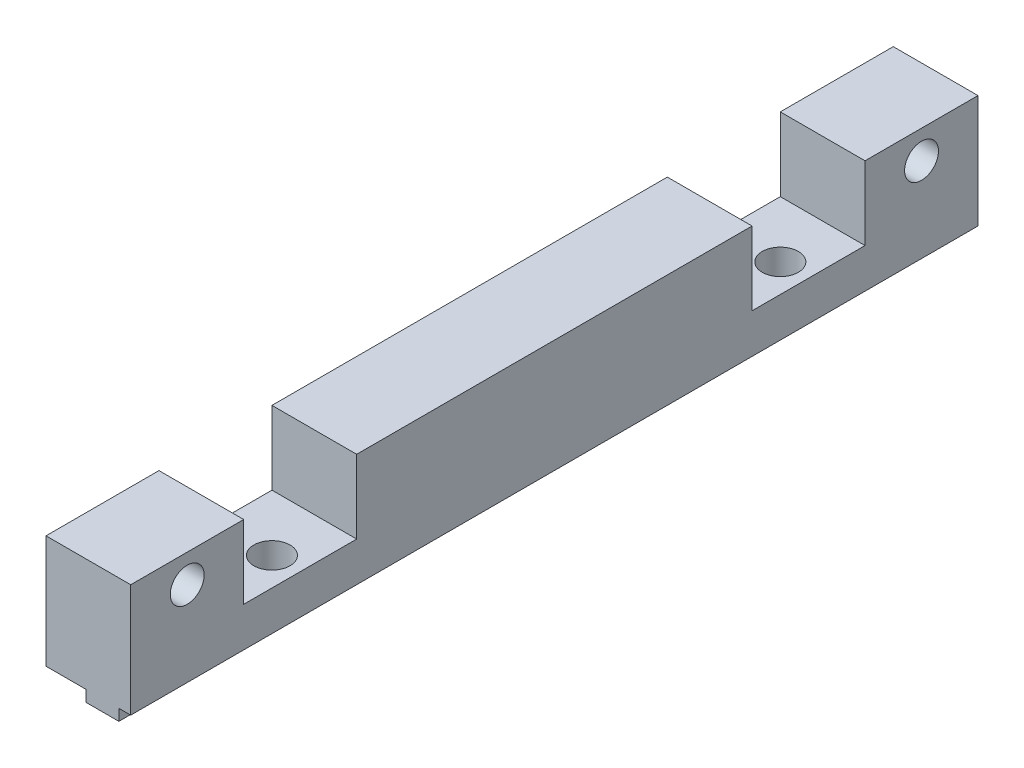
ISO-10303-21;
HEADER;
FILE_DESCRIPTION(('STEP AP214'),'2;1');
FILE_NAME('part.step','',(''),(''),'','','');
FILE_SCHEMA(('AUTOMOTIVE_DESIGN { 1 0 10303 214 1 1 1 1 }'));
ENDSEC;
DATA;
#1=APPLICATION_CONTEXT('core data for automotive mechanical design processes');
#2=APPLICATION_PROTOCOL_DEFINITION('international standard','automotive_design',2000,#1);
#3=PRODUCT_CONTEXT('',#1,'mechanical');
#4=PRODUCT('Part','Part','',(#3));
#5=PRODUCT_RELATED_PRODUCT_CATEGORY('part','',(#4));
#6=PRODUCT_DEFINITION_FORMATION('','',#4);
#7=PRODUCT_DEFINITION_CONTEXT('part definition',#1,'design');
#8=PRODUCT_DEFINITION('design','',#6,#7);
#9=PRODUCT_DEFINITION_SHAPE('','',#8);
#10=(LENGTH_UNIT() NAMED_UNIT(*) SI_UNIT(.MILLI.,.METRE.));
#11=(NAMED_UNIT(*) PLANE_ANGLE_UNIT() SI_UNIT($,.RADIAN.));
#12=(NAMED_UNIT(*) SI_UNIT($,.STERADIAN.) SOLID_ANGLE_UNIT());
#13=UNCERTAINTY_MEASURE_WITH_UNIT(LENGTH_MEASURE(1.E-05),#10,'distance_accuracy_value','');
#14=(GEOMETRIC_REPRESENTATION_CONTEXT(3) GLOBAL_UNCERTAINTY_ASSIGNED_CONTEXT((#13)) GLOBAL_UNIT_ASSIGNED_CONTEXT((#10,
#11,#12)) REPRESENTATION_CONTEXT('',''));
#15=CARTESIAN_POINT('',(0.,0.,0.));
#16=DIRECTION('',(0.,0.,1.));
#17=DIRECTION('',(1.,0.,0.));
#18=AXIS2_PLACEMENT_3D('',#15,#16,#17);
#19=CARTESIAN_POINT('',(6.45,-1.,75.));
#20=DIRECTION('',(0.,1.,0.));
#21=DIRECTION('',(0.,0.,1.));
#22=AXIS2_PLACEMENT_3D('',#19,#20,#21);
#23=PLANE('',#22);
#24=DIRECTION('',(0.,0.,-1.));
#25=VECTOR('',#24,1.);
#26=CARTESIAN_POINT('',(6.45,-1.,75.));
#27=LINE('',#26,#25);
#28=CARTESIAN_POINT('',(6.45,-1.,14.3236125370766));
#29=VERTEX_POINT('',#28);
#30=CARTESIAN_POINT('',(6.45,-1.,0.));
#31=VERTEX_POINT('',#30);
#32=EDGE_CURVE('E207',#29,#31,#27,.T.);
#33=ORIENTED_EDGE('',*,*,#32,.F.);
#34=CARTESIAN_POINT('',(5.,-1.,15.));
#35=DIRECTION('',(0.,-1.,0.));
#36=DIRECTION('',(0.,0.,-1.));
#37=AXIS2_PLACEMENT_3D('',#34,#35,#36);
#38=CIRCLE('',#37,1.6);
#39=CARTESIAN_POINT('',(3.55,-1.,14.3236125370766));
#40=VERTEX_POINT('',#39);
#41=EDGE_CURVE('E194',#40,#29,#38,.T.);
#42=ORIENTED_EDGE('',*,*,#41,.F.);
#43=DIRECTION('',(0.,0.,-1.));
#44=VECTOR('',#43,1.);
#45=CARTESIAN_POINT('',(3.55,-1.,75.));
#46=LINE('',#45,#44);
#47=CARTESIAN_POINT('',(3.55,-1.,0.));
#48=VERTEX_POINT('',#47);
#49=EDGE_CURVE('E225',#40,#48,#46,.T.);
#50=ORIENTED_EDGE('',*,*,#49,.T.);
#51=DIRECTION('',(1.,0.,0.));
#52=VECTOR('',#51,1.);
#53=CARTESIAN_POINT('',(6.45,-1.,0.));
#54=LINE('',#53,#52);
#55=EDGE_CURVE('E213',#48,#31,#54,.T.);
#56=ORIENTED_EDGE('',*,*,#55,.T.);
#57=EDGE_LOOP('',(#33,#42,#50,#56));
#58=FACE_BOUND('',#57,.T.);
#59=ADVANCED_FACE('F33',(#58),#23,.F.);
#60=CARTESIAN_POINT('',(6.45,0.,75.));
#61=DIRECTION('',(-1.,0.,0.));
#62=DIRECTION('',(0.,-1.,0.));
#63=AXIS2_PLACEMENT_3D('',#60,#61,#62);
#64=PLANE('',#63);
#65=DIRECTION('',(0.,0.,-1.));
#66=VECTOR('',#65,1.);
#67=CARTESIAN_POINT('',(6.45,0.,75.));
#68=LINE('',#67,#66);
#69=CARTESIAN_POINT('',(6.45,0.,14.3236125370766));
#70=VERTEX_POINT('',#69);
#71=CARTESIAN_POINT('',(6.45,0.,0.));
#72=VERTEX_POINT('',#71);
#73=EDGE_CURVE('E209',#70,#72,#68,.T.);
#74=ORIENTED_EDGE('',*,*,#73,.F.);
#75=DIRECTION('',(0.,-1.,0.));
#76=VECTOR('',#75,1.);
#77=CARTESIAN_POINT('',(6.45000000000002,10.,14.3236125370766));
#78=LINE('',#77,#76);
#79=EDGE_CURVE('E50',#70,#29,#78,.T.);
#80=ORIENTED_EDGE('',*,*,#79,.T.);
#81=ORIENTED_EDGE('',*,*,#32,.T.);
#82=DIRECTION('',(0.,1.,0.));
#83=VECTOR('',#82,1.);
#84=CARTESIAN_POINT('',(6.45,0.,0.));
#85=LINE('',#84,#83);
#86=EDGE_CURVE('E357',#31,#72,#85,.T.);
#87=ORIENTED_EDGE('',*,*,#86,.T.);
#88=EDGE_LOOP('',(#74,#80,#81,#87));
#89=FACE_BOUND('',#88,.T.);
#90=ADVANCED_FACE('F205',(#89),#64,.F.);
#91=CARTESIAN_POINT('',(3.55,-1.,75.));
#92=DIRECTION('',(1.,0.,0.));
#93=DIRECTION('',(0.,1.,0.));
#94=AXIS2_PLACEMENT_3D('',#91,#92,#93);
#95=PLANE('',#94);
#96=DIRECTION('',(0.,0.,-1.));
#97=VECTOR('',#96,1.);
#98=CARTESIAN_POINT('',(3.55,0.,75.));
#99=LINE('',#98,#97);
#100=CARTESIAN_POINT('',(3.54999999999999,0.,59.3236125370766));
#101=VERTEX_POINT('',#100);
#102=CARTESIAN_POINT('',(3.55,0.,15.6763874629234));
#103=VERTEX_POINT('',#102);
#104=EDGE_CURVE('E241',#101,#103,#99,.T.);
#105=ORIENTED_EDGE('',*,*,#104,.T.);
#106=DIRECTION('',(0.,-1.,0.));
#107=VECTOR('',#106,1.);
#108=CARTESIAN_POINT('',(3.54999999999999,10.,15.6763874629234));
#109=LINE('',#108,#107);
#110=CARTESIAN_POINT('',(3.55,-1.,15.6763874629234));
#111=VERTEX_POINT('',#110);
#112=EDGE_CURVE('E398',#103,#111,#109,.T.);
#113=ORIENTED_EDGE('',*,*,#112,.T.);
#114=CARTESIAN_POINT('',(3.55,-1.,59.3236125370766));
#115=VERTEX_POINT('',#114);
#116=EDGE_CURVE('E230',#115,#111,#46,.T.);
#117=ORIENTED_EDGE('',*,*,#116,.F.);
#118=DIRECTION('',(0.,-1.,0.));
#119=VECTOR('',#118,1.);
#120=CARTESIAN_POINT('',(3.54999999999999,10.,59.3236125370766));
#121=LINE('',#120,#119);
#122=EDGE_CURVE('E263',#115,#101,#121,.F.);
#123=ORIENTED_EDGE('',*,*,#122,.T.);
#124=EDGE_LOOP('',(#105,#113,#117,#123));
#125=FACE_BOUND('',#124,.T.);
#126=ADVANCED_FACE('F440',(#125),#95,.F.);
#127=CARTESIAN_POINT('',(3.55,0.,75.));
#128=VERTEX_POINT('',#127);
#129=CARTESIAN_POINT('',(3.55,0.,60.6763874629234));
#130=VERTEX_POINT('',#129);
#131=EDGE_CURVE('E42',#128,#130,#99,.T.);
#132=ORIENTED_EDGE('',*,*,#131,.T.);
#133=DIRECTION('',(0.,-1.,0.));
#134=VECTOR('',#133,1.);
#135=CARTESIAN_POINT('',(3.54999999999999,10.,60.6763874629234));
#136=LINE('',#135,#134);
#137=CARTESIAN_POINT('',(3.55,-1.,60.6763874629234));
#138=VERTEX_POINT('',#137);
#139=EDGE_CURVE('E252',#130,#138,#136,.T.);
#140=ORIENTED_EDGE('',*,*,#139,.T.);
#141=CARTESIAN_POINT('',(3.55,-1.,75.));
#142=VERTEX_POINT('',#141);
#143=EDGE_CURVE('E231',#142,#138,#46,.T.);
#144=ORIENTED_EDGE('',*,*,#143,.F.);
#145=DIRECTION('',(0.,-1.,0.));
#146=VECTOR('',#145,1.);
#147=CARTESIAN_POINT('',(3.55,-1.,75.));
#148=LINE('',#147,#146);
#149=EDGE_CURVE('E253',#128,#142,#148,.T.);
#150=ORIENTED_EDGE('',*,*,#149,.F.);
#151=EDGE_LOOP('',(#132,#140,#144,#150));
#152=FACE_BOUND('',#151,.T.);
#153=ADVANCED_FACE('F251',(#152),#95,.F.);
#154=ORIENTED_EDGE('',*,*,#116,.T.);
#155=CARTESIAN_POINT('',(6.45,-1.,15.6763874629234));
#156=VERTEX_POINT('',#155);
#157=EDGE_CURVE('E201',#156,#111,#38,.T.);
#158=ORIENTED_EDGE('',*,*,#157,.F.);
#159=CARTESIAN_POINT('',(6.45,-1.,59.3236125370766));
#160=VERTEX_POINT('',#159);
#161=EDGE_CURVE('E215',#160,#156,#27,.T.);
#162=ORIENTED_EDGE('',*,*,#161,.F.);
#163=CARTESIAN_POINT('',(5.,-1.,60.));
#164=DIRECTION('',(0.,-1.,0.));
#165=DIRECTION('',(0.,0.,-1.));
#166=AXIS2_PLACEMENT_3D('',#163,#164,#165);
#167=CIRCLE('',#166,1.6);
#168=EDGE_CURVE('E401',#115,#160,#167,.T.);
#169=ORIENTED_EDGE('',*,*,#168,.F.);
#170=EDGE_LOOP('',(#154,#158,#162,#169));
#171=FACE_BOUND('',#170,.T.);
#172=ADVANCED_FACE('F436',(#171),#23,.F.);
#173=ORIENTED_EDGE('',*,*,#161,.T.);
#174=DIRECTION('',(0.,-1.,0.));
#175=VECTOR('',#174,1.);
#176=CARTESIAN_POINT('',(6.45000000000002,10.,15.6763874629234));
#177=LINE('',#176,#175);
#178=CARTESIAN_POINT('',(6.45,0.,15.6763874629234));
#179=VERTEX_POINT('',#178);
#180=EDGE_CURVE('E210',#156,#179,#177,.F.);
#181=ORIENTED_EDGE('',*,*,#180,.T.);
#182=CARTESIAN_POINT('',(6.45,0.,59.3236125370766));
#183=VERTEX_POINT('',#182);
#184=EDGE_CURVE('E221',#183,#179,#68,.T.);
#185=ORIENTED_EDGE('',*,*,#184,.F.);
#186=DIRECTION('',(0.,-1.,0.));
#187=VECTOR('',#186,1.);
#188=CARTESIAN_POINT('',(6.45000000000002,10.,59.3236125370766));
#189=LINE('',#188,#187);
#190=EDGE_CURVE('E58',#183,#160,#189,.T.);
#191=ORIENTED_EDGE('',*,*,#190,.T.);
#192=EDGE_LOOP('',(#173,#181,#185,#191));
#193=FACE_BOUND('',#192,.T.);
#194=ADVANCED_FACE('F389',(#193),#64,.F.);
#195=CARTESIAN_POINT('',(0.,10.,75.));
#196=DIRECTION('',(0.,-1.,0.));
#197=DIRECTION('',(0.,0.,-1.));
#198=AXIS2_PLACEMENT_3D('',#195,#196,#197);
#199=PLANE('',#198);
#200=DIRECTION('',(0.,0.,-1.));
#201=VECTOR('',#200,1.);
#202=CARTESIAN_POINT('',(7.5,10.,75.));
#203=LINE('',#202,#201);
#204=CARTESIAN_POINT('',(7.5,10.,55.));
#205=VERTEX_POINT('',#204);
#206=CARTESIAN_POINT('',(7.5,10.,20.));
#207=VERTEX_POINT('',#206);
#208=EDGE_CURVE('E375',#205,#207,#203,.T.);
#209=ORIENTED_EDGE('',*,*,#208,.T.);
#210=DIRECTION('',(1.,0.,0.));
#211=VECTOR('',#210,1.);
#212=CARTESIAN_POINT('',(0.,10.,20.));
#213=LINE('',#212,#211);
#214=CARTESIAN_POINT('',(0.,10.,20.));
#215=VERTEX_POINT('',#214);
#216=EDGE_CURVE('E287',#215,#207,#213,.T.);
#217=ORIENTED_EDGE('',*,*,#216,.F.);
#218=DIRECTION('',(0.,0.,-1.));
#219=VECTOR('',#218,1.);
#220=CARTESIAN_POINT('',(0.,10.,75.));
#221=LINE('',#220,#219);
#222=CARTESIAN_POINT('',(0.,10.,55.));
#223=VERTEX_POINT('',#222);
#224=EDGE_CURVE('E370',#223,#215,#221,.T.);
#225=ORIENTED_EDGE('',*,*,#224,.F.);
#226=DIRECTION('',(1.,0.,0.));
#227=VECTOR('',#226,1.);
#228=CARTESIAN_POINT('',(0.,10.,55.));
#229=LINE('',#228,#227);
#230=EDGE_CURVE('E316',#223,#205,#229,.T.);
#231=ORIENTED_EDGE('',*,*,#230,.T.);
#232=EDGE_LOOP('',(#209,#217,#225,#231));
#233=FACE_BOUND('',#232,.T.);
#234=ADVANCED_FACE('F471',(#233),#199,.F.);
#235=CARTESIAN_POINT('',(7.5,10.,75.));
#236=VERTEX_POINT('',#235);
#237=CARTESIAN_POINT('',(7.5,10.,65.));
#238=VERTEX_POINT('',#237);
#239=EDGE_CURVE('E371',#236,#238,#203,.T.);
#240=ORIENTED_EDGE('',*,*,#239,.T.);
#241=DIRECTION('',(1.,0.,0.));
#242=VECTOR('',#241,1.);
#243=CARTESIAN_POINT('',(0.,10.,65.));
#244=LINE('',#243,#242);
#245=CARTESIAN_POINT('',(0.,10.,65.));
#246=VERTEX_POINT('',#245);
#247=EDGE_CURVE('E313',#246,#238,#244,.T.);
#248=ORIENTED_EDGE('',*,*,#247,.F.);
#249=CARTESIAN_POINT('',(0.,10.,75.));
#250=VERTEX_POINT('',#249);
#251=EDGE_CURVE('E366',#250,#246,#221,.T.);
#252=ORIENTED_EDGE('',*,*,#251,.F.);
#253=DIRECTION('',(-1.,0.,0.));
#254=VECTOR('',#253,1.);
#255=CARTESIAN_POINT('',(0.,10.,75.));
#256=LINE('',#255,#254);
#257=EDGE_CURVE('E347',#236,#250,#256,.T.);
#258=ORIENTED_EDGE('',*,*,#257,.F.);
#259=EDGE_LOOP('',(#240,#248,#252,#258));
#260=FACE_BOUND('',#259,.T.);
#261=ADVANCED_FACE('F478',(#260),#199,.F.);
#262=CARTESIAN_POINT('',(0.,0.,75.));
#263=DIRECTION('',(1.,0.,0.));
#264=DIRECTION('',(0.,1.,0.));
#265=AXIS2_PLACEMENT_3D('',#262,#263,#264);
#266=PLANE('',#265);
#267=ORIENTED_EDGE('',*,*,#224,.T.);
#268=DIRECTION('',(0.,-1.,0.));
#269=VECTOR('',#268,1.);
#270=CARTESIAN_POINT('',(0.,10.,20.));
#271=LINE('',#270,#269);
#272=CARTESIAN_POINT('',(0.,3.5,20.));
#273=VERTEX_POINT('',#272);
#274=EDGE_CURVE('E270',#215,#273,#271,.T.);
#275=ORIENTED_EDGE('',*,*,#274,.T.);
#276=DIRECTION('',(0.,0.,-1.));
#277=VECTOR('',#276,1.);
#278=CARTESIAN_POINT('',(0.,3.5,20.));
#279=LINE('',#278,#277);
#280=CARTESIAN_POINT('',(0.,3.5,10.));
#281=VERTEX_POINT('',#280);
#282=EDGE_CURVE('E273',#273,#281,#279,.T.);
#283=ORIENTED_EDGE('',*,*,#282,.T.);
#284=DIRECTION('',(0.,1.,0.));
#285=VECTOR('',#284,1.);
#286=CARTESIAN_POINT('',(0.,10.,10.));
#287=LINE('',#286,#285);
#288=CARTESIAN_POINT('',(0.,10.,10.));
#289=VERTEX_POINT('',#288);
#290=EDGE_CURVE('E277',#281,#289,#287,.T.);
#291=ORIENTED_EDGE('',*,*,#290,.T.);
#292=CARTESIAN_POINT('',(0.,10.,0.));
#293=VERTEX_POINT('',#292);
#294=EDGE_CURVE('E349',#289,#293,#221,.T.);
#295=ORIENTED_EDGE('',*,*,#294,.T.);
#296=DIRECTION('',(0.,-1.,0.));
#297=VECTOR('',#296,1.);
#298=CARTESIAN_POINT('',(0.,0.,0.));
#299=LINE('',#298,#297);
#300=CARTESIAN_POINT('',(0.,0.,0.));
#301=VERTEX_POINT('',#300);
#302=EDGE_CURVE('E331',#293,#301,#299,.T.);
#303=ORIENTED_EDGE('',*,*,#302,.T.);
#304=DIRECTION('',(0.,0.,-1.));
#305=VECTOR('',#304,1.);
#306=CARTESIAN_POINT('',(0.,0.,75.));
#307=LINE('',#306,#305);
#308=CARTESIAN_POINT('',(0.,0.,75.));
#309=VERTEX_POINT('',#308);
#310=EDGE_CURVE('E11',#309,#301,#307,.T.);
#311=ORIENTED_EDGE('',*,*,#310,.F.);
#312=DIRECTION('',(0.,-1.,0.));
#313=VECTOR('',#312,1.);
#314=CARTESIAN_POINT('',(0.,0.,75.));
#315=LINE('',#314,#313);
#316=EDGE_CURVE('E334',#250,#309,#315,.T.);
#317=ORIENTED_EDGE('',*,*,#316,.F.);
#318=ORIENTED_EDGE('',*,*,#251,.T.);
#319=DIRECTION('',(0.,-1.,0.));
#320=VECTOR('',#319,1.);
#321=CARTESIAN_POINT('',(0.,10.,65.));
#322=LINE('',#321,#320);
#323=CARTESIAN_POINT('',(0.,3.5,65.));
#324=VERTEX_POINT('',#323);
#325=EDGE_CURVE('E296',#246,#324,#322,.T.);
#326=ORIENTED_EDGE('',*,*,#325,.T.);
#327=DIRECTION('',(0.,0.,-1.));
#328=VECTOR('',#327,1.);
#329=CARTESIAN_POINT('',(0.,3.5,65.));
#330=LINE('',#329,#328);
#331=CARTESIAN_POINT('',(0.,3.5,55.));
#332=VERTEX_POINT('',#331);
#333=EDGE_CURVE('E299',#324,#332,#330,.T.);
#334=ORIENTED_EDGE('',*,*,#333,.T.);
#335=DIRECTION('',(0.,1.,0.));
#336=VECTOR('',#335,1.);
#337=CARTESIAN_POINT('',(0.,10.,55.));
#338=LINE('',#337,#336);
#339=EDGE_CURVE('E303',#332,#223,#338,.T.);
#340=ORIENTED_EDGE('',*,*,#339,.T.);
#341=EDGE_LOOP('',(#267,#275,#283,#291,#295,#303,#311,#317,#318,#326,#334,#340));
#342=FACE_BOUND('',#341,.T.);
#343=CARTESIAN_POINT('',(0.,7.5,70.));
#344=DIRECTION('',(1.,0.,0.));
#345=DIRECTION('',(0.,0.,-1.));
#346=AXIS2_PLACEMENT_3D('',#343,#344,#345);
#347=CIRCLE('',#346,1.5);
#348=CARTESIAN_POINT('',(0.,7.5,68.5));
#349=VERTEX_POINT('',#348);
#350=EDGE_CURVE('E322',#349,#349,#347,.T.);
#351=ORIENTED_EDGE('',*,*,#350,.T.);
#352=EDGE_LOOP('',(#351));
#353=FACE_BOUND('',#352,.T.);
#354=CARTESIAN_POINT('',(0.,7.5,5.));
#355=DIRECTION('',(1.,0.,0.));
#356=DIRECTION('',(0.,0.,-1.));
#357=AXIS2_PLACEMENT_3D('',#354,#355,#356);
#358=CIRCLE('',#357,1.5);
#359=CARTESIAN_POINT('',(0.,7.5,3.5));
#360=VERTEX_POINT('',#359);
#361=EDGE_CURVE('E328',#360,#360,#358,.T.);
#362=ORIENTED_EDGE('',*,*,#361,.T.);
#363=EDGE_LOOP('',(#362));
#364=FACE_BOUND('',#363,.T.);
#365=ADVANCED_FACE('F35',(#342,#353,#364),#266,.F.);
#366=CARTESIAN_POINT('',(3.55,0.,75.));
#367=DIRECTION('',(0.,1.,0.));
#368=DIRECTION('',(0.,0.,1.));
#369=AXIS2_PLACEMENT_3D('',#366,#367,#368);
#370=PLANE('',#369);
#371=CARTESIAN_POINT('',(3.54999999999999,0.,14.3236125370766));
#372=VERTEX_POINT('',#371);
#373=CARTESIAN_POINT('',(3.55,0.,0.));
#374=VERTEX_POINT('',#373);
#375=EDGE_CURVE('E236',#372,#374,#99,.T.);
#376=ORIENTED_EDGE('',*,*,#375,.F.);
#377=CARTESIAN_POINT('',(5.,0.,15.));
#378=DIRECTION('',(0.,1.,0.));
#379=DIRECTION('',(0.,0.,1.));
#380=AXIS2_PLACEMENT_3D('',#377,#378,#379);
#381=CIRCLE('',#380,1.6);
#382=EDGE_CURVE('E396',#372,#103,#381,.T.);
#383=ORIENTED_EDGE('',*,*,#382,.T.);
#384=ORIENTED_EDGE('',*,*,#104,.F.);
#385=CARTESIAN_POINT('',(5.,0.,60.));
#386=DIRECTION('',(0.,1.,0.));
#387=DIRECTION('',(0.,0.,1.));
#388=AXIS2_PLACEMENT_3D('',#385,#386,#387);
#389=CIRCLE('',#388,1.6);
#390=EDGE_CURVE('E260',#101,#130,#389,.T.);
#391=ORIENTED_EDGE('',*,*,#390,.T.);
#392=ORIENTED_EDGE('',*,*,#131,.F.);
#393=DIRECTION('',(1.,0.,0.));
#394=VECTOR('',#393,1.);
#395=CARTESIAN_POINT('',(3.55,0.,75.));
#396=LINE('',#395,#394);
#397=EDGE_CURVE('E257',#309,#128,#396,.T.);
#398=ORIENTED_EDGE('',*,*,#397,.F.);
#399=ORIENTED_EDGE('',*,*,#310,.T.);
#400=DIRECTION('',(1.,0.,0.));
#401=VECTOR('',#400,1.);
#402=CARTESIAN_POINT('',(3.55,0.,0.));
#403=LINE('',#402,#401);
#404=EDGE_CURVE('E352',#301,#374,#403,.T.);
#405=ORIENTED_EDGE('',*,*,#404,.T.);
#406=EDGE_LOOP('',(#376,#383,#384,#391,#392,#398,#399,#405));
#407=FACE_BOUND('',#406,.T.);
#408=ADVANCED_FACE('F256',(#407),#370,.F.);
#409=ORIENTED_EDGE('',*,*,#49,.F.);
#410=DIRECTION('',(0.,-1.,0.));
#411=VECTOR('',#410,1.);
#412=CARTESIAN_POINT('',(3.54999999999999,10.,14.3236125370766));
#413=LINE('',#412,#411);
#414=EDGE_CURVE('E197',#40,#372,#413,.F.);
#415=ORIENTED_EDGE('',*,*,#414,.T.);
#416=ORIENTED_EDGE('',*,*,#375,.T.);
#417=DIRECTION('',(0.,-1.,0.));
#418=VECTOR('',#417,1.);
#419=CARTESIAN_POINT('',(3.55,-1.,0.));
#420=LINE('',#419,#418);
#421=EDGE_CURVE('E354',#374,#48,#420,.T.);
#422=ORIENTED_EDGE('',*,*,#421,.T.);
#423=EDGE_LOOP('',(#409,#415,#416,#422));
#424=FACE_BOUND('',#423,.T.);
#425=ADVANCED_FACE('F446',(#424),#95,.F.);
#426=ORIENTED_EDGE('',*,*,#143,.T.);
#427=CARTESIAN_POINT('',(6.45,-1.,60.6763874629234));
#428=VERTEX_POINT('',#427);
#429=EDGE_CURVE('E403',#428,#138,#167,.T.);
#430=ORIENTED_EDGE('',*,*,#429,.F.);
#431=CARTESIAN_POINT('',(6.45,-1.,75.));
#432=VERTEX_POINT('',#431);
#433=EDGE_CURVE('E218',#432,#428,#27,.T.);
#434=ORIENTED_EDGE('',*,*,#433,.F.);
#435=DIRECTION('',(1.,0.,0.));
#436=VECTOR('',#435,1.);
#437=CARTESIAN_POINT('',(6.45,-1.,75.));
#438=LINE('',#437,#436);
#439=EDGE_CURVE('E339',#142,#432,#438,.T.);
#440=ORIENTED_EDGE('',*,*,#439,.F.);
#441=EDGE_LOOP('',(#426,#430,#434,#440));
#442=FACE_BOUND('',#441,.T.);
#443=ADVANCED_FACE('F413',(#442),#23,.F.);
#444=ORIENTED_EDGE('',*,*,#433,.T.);
#445=DIRECTION('',(0.,-1.,0.));
#446=VECTOR('',#445,1.);
#447=CARTESIAN_POINT('',(6.45000000000002,10.,60.6763874629234));
#448=LINE('',#447,#446);
#449=CARTESIAN_POINT('',(6.45,0.,60.6763874629234));
#450=VERTEX_POINT('',#449);
#451=EDGE_CURVE('E405',#428,#450,#448,.F.);
#452=ORIENTED_EDGE('',*,*,#451,.T.);
#453=CARTESIAN_POINT('',(6.45,0.,75.));
#454=VERTEX_POINT('',#453);
#455=EDGE_CURVE('E216',#454,#450,#68,.T.);
#456=ORIENTED_EDGE('',*,*,#455,.F.);
#457=DIRECTION('',(0.,1.,0.));
#458=VECTOR('',#457,1.);
#459=CARTESIAN_POINT('',(6.45,0.,75.));
#460=LINE('',#459,#458);
#461=EDGE_CURVE('E341',#432,#454,#460,.T.);
#462=ORIENTED_EDGE('',*,*,#461,.F.);
#463=EDGE_LOOP('',(#444,#452,#456,#462));
#464=FACE_BOUND('',#463,.T.);
#465=ADVANCED_FACE('F408',(#464),#64,.F.);
#466=CARTESIAN_POINT('',(7.5,0.,75.));
#467=DIRECTION('',(0.,1.,0.));
#468=DIRECTION('',(-1.,0.,0.));
#469=AXIS2_PLACEMENT_3D('',#466,#467,#468);
#470=PLANE('',#469);
#471=ORIENTED_EDGE('',*,*,#184,.T.);
#472=CARTESIAN_POINT('',(5.,0.,15.));
#473=DIRECTION('',(0.,1.,0.));
#474=DIRECTION('',(-1.,0.,0.));
#475=AXIS2_PLACEMENT_3D('',#472,#473,#474);
#476=CIRCLE('',#475,1.6);
#477=EDGE_CURVE('E385',#179,#70,#476,.T.);
#478=ORIENTED_EDGE('',*,*,#477,.T.);
#479=ORIENTED_EDGE('',*,*,#73,.T.);
#480=DIRECTION('',(1.,0.,0.));
#481=VECTOR('',#480,1.);
#482=CARTESIAN_POINT('',(7.5,0.,0.));
#483=LINE('',#482,#481);
#484=CARTESIAN_POINT('',(7.5,0.,0.));
#485=VERTEX_POINT('',#484);
#486=EDGE_CURVE('E359',#72,#485,#483,.T.);
#487=ORIENTED_EDGE('',*,*,#486,.T.);
#488=DIRECTION('',(0.,0.,-1.));
#489=VECTOR('',#488,1.);
#490=CARTESIAN_POINT('',(7.5,0.,75.));
#491=LINE('',#490,#489);
#492=CARTESIAN_POINT('',(7.5,0.,75.));
#493=VERTEX_POINT('',#492);
#494=EDGE_CURVE('E374',#493,#485,#491,.T.);
#495=ORIENTED_EDGE('',*,*,#494,.F.);
#496=DIRECTION('',(1.,0.,0.));
#497=VECTOR('',#496,1.);
#498=CARTESIAN_POINT('',(7.5,0.,75.));
#499=LINE('',#498,#497);
#500=EDGE_CURVE('E343',#454,#493,#499,.T.);
#501=ORIENTED_EDGE('',*,*,#500,.F.);
#502=ORIENTED_EDGE('',*,*,#455,.T.);
#503=CARTESIAN_POINT('',(5.,0.,60.));
#504=DIRECTION('',(0.,1.,0.));
#505=DIRECTION('',(-1.,0.,0.));
#506=AXIS2_PLACEMENT_3D('',#503,#504,#505);
#507=CIRCLE('',#506,1.6);
#508=EDGE_CURVE('E386',#450,#183,#507,.T.);
#509=ORIENTED_EDGE('',*,*,#508,.T.);
#510=EDGE_LOOP('',(#471,#478,#479,#487,#495,#501,#502,#509));
#511=FACE_BOUND('',#510,.T.);
#512=ADVANCED_FACE('F384',(#511),#470,.F.);
#513=CARTESIAN_POINT('',(7.5,10.,75.));
#514=DIRECTION('',(-1.,0.,0.));
#515=DIRECTION('',(0.,0.,1.));
#516=AXIS2_PLACEMENT_3D('',#513,#514,#515);
#517=PLANE('',#516);
#518=CARTESIAN_POINT('',(7.5,7.5,70.));
#519=DIRECTION('',(1.,0.,0.));
#520=DIRECTION('',(0.,0.,-1.));
#521=AXIS2_PLACEMENT_3D('',#518,#519,#520);
#522=CIRCLE('',#521,1.5);
#523=CARTESIAN_POINT('',(7.5,7.5,68.5));
#524=VERTEX_POINT('',#523);
#525=EDGE_CURVE('E315',#524,#524,#522,.T.);
#526=ORIENTED_EDGE('',*,*,#525,.F.);
#527=EDGE_LOOP('',(#526));
#528=FACE_BOUND('',#527,.T.);
#529=CARTESIAN_POINT('',(7.5,7.5,5.));
#530=DIRECTION('',(1.,0.,0.));
#531=DIRECTION('',(0.,0.,-1.));
#532=AXIS2_PLACEMENT_3D('',#529,#530,#531);
#533=CIRCLE('',#532,1.5);
#534=CARTESIAN_POINT('',(7.5,7.5,3.5));
#535=VERTEX_POINT('',#534);
#536=EDGE_CURVE('E325',#535,#535,#533,.T.);
#537=ORIENTED_EDGE('',*,*,#536,.F.);
#538=EDGE_LOOP('',(#537));
#539=FACE_BOUND('',#538,.T.);
#540=DIRECTION('',(0.,0.,-1.));
#541=VECTOR('',#540,1.);
#542=CARTESIAN_POINT('',(7.5,3.5,20.));
#543=LINE('',#542,#541);
#544=CARTESIAN_POINT('',(7.5,3.5,20.));
#545=VERTEX_POINT('',#544);
#546=CARTESIAN_POINT('',(7.5,3.5,10.));
#547=VERTEX_POINT('',#546);
#548=EDGE_CURVE('E283',#545,#547,#543,.T.);
#549=ORIENTED_EDGE('',*,*,#548,.F.);
#550=DIRECTION('',(0.,-1.,0.));
#551=VECTOR('',#550,1.);
#552=CARTESIAN_POINT('',(7.5,10.,20.));
#553=LINE('',#552,#551);
#554=EDGE_CURVE('E265',#207,#545,#553,.T.);
#555=ORIENTED_EDGE('',*,*,#554,.F.);
#556=ORIENTED_EDGE('',*,*,#208,.F.);
#557=DIRECTION('',(0.,1.,0.));
#558=VECTOR('',#557,1.);
#559=CARTESIAN_POINT('',(7.5,10.,55.));
#560=LINE('',#559,#558);
#561=CARTESIAN_POINT('',(7.5,3.5,55.));
#562=VERTEX_POINT('',#561);
#563=EDGE_CURVE('E300',#562,#205,#560,.T.);
#564=ORIENTED_EDGE('',*,*,#563,.F.);
#565=DIRECTION('',(0.,0.,-1.));
#566=VECTOR('',#565,1.);
#567=CARTESIAN_POINT('',(7.5,3.5,65.));
#568=LINE('',#567,#566);
#569=CARTESIAN_POINT('',(7.5,3.5,65.));
#570=VERTEX_POINT('',#569);
#571=EDGE_CURVE('E309',#570,#562,#568,.T.);
#572=ORIENTED_EDGE('',*,*,#571,.F.);
#573=DIRECTION('',(0.,-1.,0.));
#574=VECTOR('',#573,1.);
#575=CARTESIAN_POINT('',(7.5,10.,65.));
#576=LINE('',#575,#574);
#577=EDGE_CURVE('E289',#238,#570,#576,.T.);
#578=ORIENTED_EDGE('',*,*,#577,.F.);
#579=ORIENTED_EDGE('',*,*,#239,.F.);
#580=DIRECTION('',(0.,1.,0.));
#581=VECTOR('',#580,1.);
#582=CARTESIAN_POINT('',(7.5,10.,75.));
#583=LINE('',#582,#581);
#584=EDGE_CURVE('E345',#493,#236,#583,.T.);
#585=ORIENTED_EDGE('',*,*,#584,.F.);
#586=ORIENTED_EDGE('',*,*,#494,.T.);
#587=DIRECTION('',(0.,1.,0.));
#588=VECTOR('',#587,1.);
#589=CARTESIAN_POINT('',(7.5,10.,0.));
#590=LINE('',#589,#588);
#591=CARTESIAN_POINT('',(7.5,10.,0.));
#592=VERTEX_POINT('',#591);
#593=EDGE_CURVE('E361',#485,#592,#590,.T.);
#594=ORIENTED_EDGE('',*,*,#593,.T.);
#595=CARTESIAN_POINT('',(7.5,10.,9.99999999999999));
#596=VERTEX_POINT('',#595);
#597=EDGE_CURVE('E369',#596,#592,#203,.T.);
#598=ORIENTED_EDGE('',*,*,#597,.F.);
#599=DIRECTION('',(0.,1.,0.));
#600=VECTOR('',#599,1.);
#601=CARTESIAN_POINT('',(7.5,10.,10.));
#602=LINE('',#601,#600);
#603=EDGE_CURVE('E274',#547,#596,#602,.T.);
#604=ORIENTED_EDGE('',*,*,#603,.F.);
#605=EDGE_LOOP('',(#549,#555,#556,#564,#572,#578,#579,#585,#586,#594,#598,#604));
#606=FACE_BOUND('',#605,.T.);
#607=ADVANCED_FACE('F521',(#528,#539,#606),#517,.F.);
#608=ORIENTED_EDGE('',*,*,#294,.F.);
#609=DIRECTION('',(1.,0.,0.));
#610=VECTOR('',#609,1.);
#611=CARTESIAN_POINT('',(0.,10.,10.));
#612=LINE('',#611,#610);
#613=EDGE_CURVE('E290',#289,#596,#612,.T.);
#614=ORIENTED_EDGE('',*,*,#613,.T.);
#615=ORIENTED_EDGE('',*,*,#597,.T.);
#616=DIRECTION('',(-1.,0.,0.));
#617=VECTOR('',#616,1.);
#618=CARTESIAN_POINT('',(0.,10.,0.));
#619=LINE('',#618,#617);
#620=EDGE_CURVE('E336',#592,#293,#619,.T.);
#621=ORIENTED_EDGE('',*,*,#620,.T.);
#622=EDGE_LOOP('',(#608,#614,#615,#621));
#623=FACE_BOUND('',#622,.T.);
#624=ADVANCED_FACE('F481',(#623),#199,.F.);
#625=CARTESIAN_POINT('',(0.,0.,75.));
#626=DIRECTION('',(0.,0.,-1.));
#627=DIRECTION('',(-1.,0.,0.));
#628=AXIS2_PLACEMENT_3D('',#625,#626,#627);
#629=PLANE('',#628);
#630=ORIENTED_EDGE('',*,*,#316,.T.);
#631=ORIENTED_EDGE('',*,*,#397,.T.);
#632=ORIENTED_EDGE('',*,*,#149,.T.);
#633=ORIENTED_EDGE('',*,*,#439,.T.);
#634=ORIENTED_EDGE('',*,*,#461,.T.);
#635=ORIENTED_EDGE('',*,*,#500,.T.);
#636=ORIENTED_EDGE('',*,*,#584,.T.);
#637=ORIENTED_EDGE('',*,*,#257,.T.);
#638=EDGE_LOOP('',(#630,#631,#632,#633,#634,#635,#636,#637));
#639=FACE_BOUND('',#638,.T.);
#640=ADVANCED_FACE('F411',(#639),#629,.F.);
#641=CARTESIAN_POINT('',(0.,0.,0.));
#642=DIRECTION('',(0.,0.,-1.));
#643=DIRECTION('',(-1.,0.,0.));
#644=AXIS2_PLACEMENT_3D('',#641,#642,#643);
#645=PLANE('',#644);
#646=ORIENTED_EDGE('',*,*,#302,.F.);
#647=ORIENTED_EDGE('',*,*,#620,.F.);
#648=ORIENTED_EDGE('',*,*,#593,.F.);
#649=ORIENTED_EDGE('',*,*,#486,.F.);
#650=ORIENTED_EDGE('',*,*,#86,.F.);
#651=ORIENTED_EDGE('',*,*,#55,.F.);
#652=ORIENTED_EDGE('',*,*,#421,.F.);
#653=ORIENTED_EDGE('',*,*,#404,.F.);
#654=EDGE_LOOP('',(#646,#647,#648,#649,#650,#651,#652,#653));
#655=FACE_BOUND('',#654,.T.);
#656=ADVANCED_FACE('F630',(#655),#645,.T.);
#657=CARTESIAN_POINT('',(0.,7.5,5.));
#658=DIRECTION('',(1.,0.,0.));
#659=DIRECTION('',(0.,0.,-1.));
#660=AXIS2_PLACEMENT_3D('',#657,#658,#659);
#661=CYLINDRICAL_SURFACE('',#660,1.5);
#662=ORIENTED_EDGE('',*,*,#361,.F.);
#663=EDGE_LOOP('',(#662));
#664=FACE_BOUND('',#663,.T.);
#665=ORIENTED_EDGE('',*,*,#536,.T.);
#666=EDGE_LOOP('',(#665));
#667=FACE_BOUND('',#666,.T.);
#668=ADVANCED_FACE('F633',(#664,#667),#661,.F.);
#669=CARTESIAN_POINT('',(0.,7.5,70.));
#670=DIRECTION('',(1.,0.,0.));
#671=DIRECTION('',(0.,0.,-1.));
#672=AXIS2_PLACEMENT_3D('',#669,#670,#671);
#673=CYLINDRICAL_SURFACE('',#672,1.5);
#674=ORIENTED_EDGE('',*,*,#350,.F.);
#675=EDGE_LOOP('',(#674));
#676=FACE_BOUND('',#675,.T.);
#677=ORIENTED_EDGE('',*,*,#525,.T.);
#678=EDGE_LOOP('',(#677));
#679=FACE_BOUND('',#678,.T.);
#680=ADVANCED_FACE('F605',(#676,#679),#673,.F.);
#681=CARTESIAN_POINT('',(0.,10.,65.));
#682=DIRECTION('',(0.,0.,1.));
#683=DIRECTION('',(1.,0.,0.));
#684=AXIS2_PLACEMENT_3D('',#681,#682,#683);
#685=PLANE('',#684);
#686=ORIENTED_EDGE('',*,*,#577,.T.);
#687=DIRECTION('',(1.,0.,0.));
#688=VECTOR('',#687,1.);
#689=CARTESIAN_POINT('',(0.,3.5,65.));
#690=LINE('',#689,#688);
#691=EDGE_CURVE('E306',#324,#570,#690,.T.);
#692=ORIENTED_EDGE('',*,*,#691,.F.);
#693=ORIENTED_EDGE('',*,*,#325,.F.);
#694=ORIENTED_EDGE('',*,*,#247,.T.);
#695=EDGE_LOOP('',(#686,#692,#693,#694));
#696=FACE_BOUND('',#695,.T.);
#697=ADVANCED_FACE('F595',(#696),#685,.F.);
#698=CARTESIAN_POINT('',(0.,10.,55.));
#699=DIRECTION('',(0.,0.,-1.));
#700=DIRECTION('',(-1.,0.,0.));
#701=AXIS2_PLACEMENT_3D('',#698,#699,#700);
#702=PLANE('',#701);
#703=ORIENTED_EDGE('',*,*,#563,.T.);
#704=ORIENTED_EDGE('',*,*,#230,.F.);
#705=ORIENTED_EDGE('',*,*,#339,.F.);
#706=DIRECTION('',(1.,0.,0.));
#707=VECTOR('',#706,1.);
#708=CARTESIAN_POINT('',(0.,3.5,55.));
#709=LINE('',#708,#707);
#710=EDGE_CURVE('E319',#332,#562,#709,.T.);
#711=ORIENTED_EDGE('',*,*,#710,.T.);
#712=EDGE_LOOP('',(#703,#704,#705,#711));
#713=FACE_BOUND('',#712,.T.);
#714=ADVANCED_FACE('F533',(#713),#702,.F.);
#715=CARTESIAN_POINT('',(0.,3.5,65.));
#716=DIRECTION('',(0.,-1.,0.));
#717=DIRECTION('',(0.,0.,-1.));
#718=AXIS2_PLACEMENT_3D('',#715,#716,#717);
#719=PLANE('',#718);
#720=CARTESIAN_POINT('',(5.,3.5,60.));
#721=DIRECTION('',(0.,-1.,0.));
#722=DIRECTION('',(0.,0.,-1.));
#723=AXIS2_PLACEMENT_3D('',#720,#721,#722);
#724=CIRCLE('',#723,1.6);
#725=CARTESIAN_POINT('',(5.,3.5,58.4));
#726=VERTEX_POINT('',#725);
#727=EDGE_CURVE('E406',#726,#726,#724,.T.);
#728=ORIENTED_EDGE('',*,*,#727,.T.);
#729=EDGE_LOOP('',(#728));
#730=FACE_BOUND('',#729,.T.);
#731=ORIENTED_EDGE('',*,*,#571,.T.);
#732=ORIENTED_EDGE('',*,*,#710,.F.);
#733=ORIENTED_EDGE('',*,*,#333,.F.);
#734=ORIENTED_EDGE('',*,*,#691,.T.);
#735=EDGE_LOOP('',(#731,#732,#733,#734));
#736=FACE_BOUND('',#735,.T.);
#737=ADVANCED_FACE('F417',(#730,#736),#719,.F.);
#738=CARTESIAN_POINT('',(0.,10.,20.));
#739=DIRECTION('',(0.,0.,1.));
#740=DIRECTION('',(1.,0.,0.));
#741=AXIS2_PLACEMENT_3D('',#738,#739,#740);
#742=PLANE('',#741);
#743=ORIENTED_EDGE('',*,*,#554,.T.);
#744=DIRECTION('',(1.,0.,0.));
#745=VECTOR('',#744,1.);
#746=CARTESIAN_POINT('',(0.,3.5,20.));
#747=LINE('',#746,#745);
#748=EDGE_CURVE('E280',#273,#545,#747,.T.);
#749=ORIENTED_EDGE('',*,*,#748,.F.);
#750=ORIENTED_EDGE('',*,*,#274,.F.);
#751=ORIENTED_EDGE('',*,*,#216,.T.);
#752=EDGE_LOOP('',(#743,#749,#750,#751));
#753=FACE_BOUND('',#752,.T.);
#754=ADVANCED_FACE('F532',(#753),#742,.F.);
#755=CARTESIAN_POINT('',(0.,10.,10.));
#756=DIRECTION('',(0.,0.,-1.));
#757=DIRECTION('',(0.,1.,0.));
#758=AXIS2_PLACEMENT_3D('',#755,#756,#757);
#759=PLANE('',#758);
#760=ORIENTED_EDGE('',*,*,#603,.T.);
#761=ORIENTED_EDGE('',*,*,#613,.F.);
#762=ORIENTED_EDGE('',*,*,#290,.F.);
#763=DIRECTION('',(1.,0.,0.));
#764=VECTOR('',#763,1.);
#765=CARTESIAN_POINT('',(0.,3.5,10.));
#766=LINE('',#765,#764);
#767=EDGE_CURVE('E293',#281,#547,#766,.T.);
#768=ORIENTED_EDGE('',*,*,#767,.T.);
#769=EDGE_LOOP('',(#760,#761,#762,#768));
#770=FACE_BOUND('',#769,.T.);
#771=ADVANCED_FACE('F430',(#770),#759,.F.);
#772=CARTESIAN_POINT('',(0.,3.5,20.));
#773=DIRECTION('',(0.,-1.,0.));
#774=DIRECTION('',(0.,0.,-1.));
#775=AXIS2_PLACEMENT_3D('',#772,#773,#774);
#776=PLANE('',#775);
#777=CARTESIAN_POINT('',(5.,3.5,15.));
#778=DIRECTION('',(0.,-1.,0.));
#779=DIRECTION('',(0.,0.,-1.));
#780=AXIS2_PLACEMENT_3D('',#777,#778,#779);
#781=CIRCLE('',#780,1.6);
#782=CARTESIAN_POINT('',(5.,3.5,13.4));
#783=VERTEX_POINT('',#782);
#784=EDGE_CURVE('E37',#783,#783,#781,.T.);
#785=ORIENTED_EDGE('',*,*,#784,.T.);
#786=EDGE_LOOP('',(#785));
#787=FACE_BOUND('',#786,.T.);
#788=ORIENTED_EDGE('',*,*,#548,.T.);
#789=ORIENTED_EDGE('',*,*,#767,.F.);
#790=ORIENTED_EDGE('',*,*,#282,.F.);
#791=ORIENTED_EDGE('',*,*,#748,.T.);
#792=EDGE_LOOP('',(#788,#789,#790,#791));
#793=FACE_BOUND('',#792,.T.);
#794=ADVANCED_FACE('F422',(#787,#793),#776,.F.);
#795=CARTESIAN_POINT('',(5.,10.,60.));
#796=DIRECTION('',(0.,-1.,0.));
#797=DIRECTION('',(0.,0.,-1.));
#798=AXIS2_PLACEMENT_3D('',#795,#796,#797);
#799=CYLINDRICAL_SURFACE('',#798,1.6);
#800=ORIENTED_EDGE('',*,*,#727,.F.);
#801=EDGE_LOOP('',(#800));
#802=FACE_BOUND('',#801,.T.);
#803=ORIENTED_EDGE('',*,*,#390,.F.);
#804=ORIENTED_EDGE('',*,*,#122,.F.);
#805=ORIENTED_EDGE('',*,*,#168,.T.);
#806=ORIENTED_EDGE('',*,*,#190,.F.);
#807=ORIENTED_EDGE('',*,*,#508,.F.);
#808=ORIENTED_EDGE('',*,*,#451,.F.);
#809=ORIENTED_EDGE('',*,*,#429,.T.);
#810=ORIENTED_EDGE('',*,*,#139,.F.);
#811=EDGE_LOOP('',(#803,#804,#805,#806,#807,#808,#809,#810));
#812=FACE_BOUND('',#811,.T.);
#813=ADVANCED_FACE('F420',(#802,#812),#799,.F.);
#814=CARTESIAN_POINT('',(5.,10.,15.));
#815=DIRECTION('',(0.,-1.,0.));
#816=DIRECTION('',(0.,0.,-1.));
#817=AXIS2_PLACEMENT_3D('',#814,#815,#816);
#818=CYLINDRICAL_SURFACE('',#817,1.6);
#819=ORIENTED_EDGE('',*,*,#784,.F.);
#820=EDGE_LOOP('',(#819));
#821=FACE_BOUND('',#820,.T.);
#822=ORIENTED_EDGE('',*,*,#382,.F.);
#823=ORIENTED_EDGE('',*,*,#414,.F.);
#824=ORIENTED_EDGE('',*,*,#41,.T.);
#825=ORIENTED_EDGE('',*,*,#79,.F.);
#826=ORIENTED_EDGE('',*,*,#477,.F.);
#827=ORIENTED_EDGE('',*,*,#180,.F.);
#828=ORIENTED_EDGE('',*,*,#157,.T.);
#829=ORIENTED_EDGE('',*,*,#112,.F.);
#830=EDGE_LOOP('',(#822,#823,#824,#825,#826,#827,#828,#829));
#831=FACE_BOUND('',#830,.T.);
#832=ADVANCED_FACE('F195',(#821,#831),#818,.F.);
#833=CLOSED_SHELL('',(#59,#90,#126,#153,#172,#194,#234,#261,#365,#408,#425,#443,#465,#512,#607,
#624,#640,#656,#668,#680,#697,#714,#737,#754,#771,#794,#813,#832));
#834=MANIFOLD_SOLID_BREP('B2',#833);
#835=ADVANCED_BREP_SHAPE_REPRESENTATION('',(#18,#834),#14);
#836=SHAPE_DEFINITION_REPRESENTATION(#9,#835);
ENDSEC;
END-ISO-10303-21;
